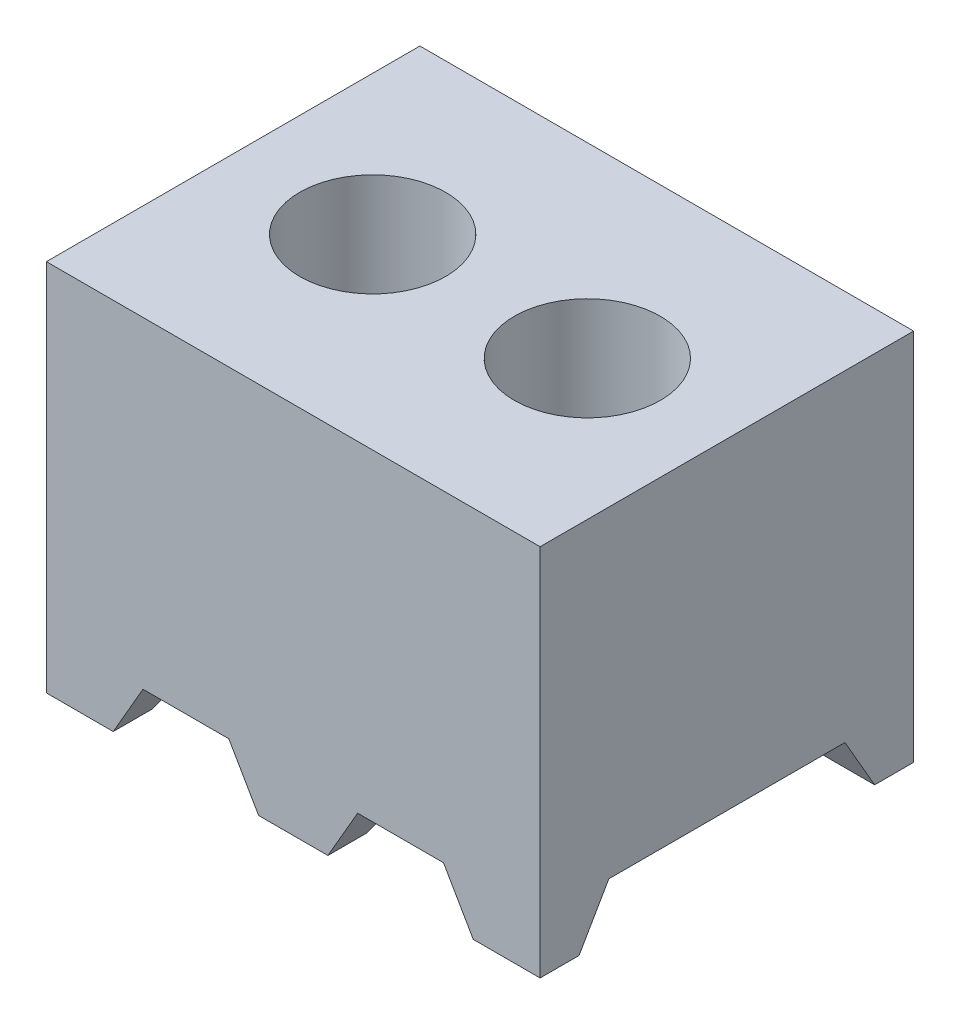
ISO-10303-21;
HEADER;
FILE_DESCRIPTION(('STEP AP214'),'2;1');
FILE_NAME('part.step','',(''),(''),'','','');
FILE_SCHEMA(('AUTOMOTIVE_DESIGN { 1 0 10303 214 1 1 1 1 }'));
ENDSEC;
DATA;
#1=APPLICATION_CONTEXT('core data for automotive mechanical design processes');
#2=APPLICATION_PROTOCOL_DEFINITION('international standard','automotive_design',2000,#1);
#3=PRODUCT_CONTEXT('',#1,'mechanical');
#4=PRODUCT('Part','Part','',(#3));
#5=PRODUCT_RELATED_PRODUCT_CATEGORY('part','',(#4));
#6=PRODUCT_DEFINITION_FORMATION('','',#4);
#7=PRODUCT_DEFINITION_CONTEXT('part definition',#1,'design');
#8=PRODUCT_DEFINITION('design','',#6,#7);
#9=PRODUCT_DEFINITION_SHAPE('','',#8);
#10=(LENGTH_UNIT() NAMED_UNIT(*) SI_UNIT(.MILLI.,.METRE.));
#11=(NAMED_UNIT(*) PLANE_ANGLE_UNIT() SI_UNIT($,.RADIAN.));
#12=(NAMED_UNIT(*) SI_UNIT($,.STERADIAN.) SOLID_ANGLE_UNIT());
#13=UNCERTAINTY_MEASURE_WITH_UNIT(LENGTH_MEASURE(1.E-05),#10,'distance_accuracy_value','');
#14=(GEOMETRIC_REPRESENTATION_CONTEXT(3) GLOBAL_UNCERTAINTY_ASSIGNED_CONTEXT((#13)) GLOBAL_UNIT_ASSIGNED_CONTEXT((#10,
#11,#12)) REPRESENTATION_CONTEXT('',''));
#15=CARTESIAN_POINT('',(0.,0.,0.));
#16=DIRECTION('',(0.,0.,1.));
#17=DIRECTION('',(1.,0.,0.));
#18=AXIS2_PLACEMENT_3D('',#15,#16,#17);
#19=CARTESIAN_POINT('',(0.,-2.2098,0.));
#20=DIRECTION('',(0.,1.,0.));
#21=DIRECTION('',(0.,0.,1.));
#22=AXIS2_PLACEMENT_3D('',#19,#20,#21);
#23=PLANE('',#22);
#24=DIRECTION('',(1.,0.,0.));
#25=VECTOR('',#24,1.);
#26=CARTESIAN_POINT('',(0.,-2.2098,0.));
#27=LINE('',#26,#25);
#28=CARTESIAN_POINT('',(2.525476362049,-2.2098,0.));
#29=VERTEX_POINT('',#28);
#30=CARTESIAN_POINT('',(2.921,-2.2098,0.));
#31=VERTEX_POINT('',#30);
#32=EDGE_CURVE('E311',#29,#31,#27,.T.);
#33=ORIENTED_EDGE('',*,*,#32,.F.);
#34=DIRECTION('',(0.,0.,1.));
#35=VECTOR('',#34,1.);
#36=CARTESIAN_POINT('',(2.525476362049,-2.2098,-2.2098));
#37=LINE('',#36,#35);
#38=CARTESIAN_POINT('',(2.525476362049,-2.2098,-0.230423637951));
#39=VERTEX_POINT('',#38);
#40=EDGE_CURVE('E215',#39,#29,#37,.T.);
#41=ORIENTED_EDGE('',*,*,#40,.F.);
#42=DIRECTION('',(1.,0.,0.));
#43=VECTOR('',#42,1.);
#44=CARTESIAN_POINT('',(0.,-2.2098,-0.230423637951));
#45=LINE('',#44,#43);
#46=CARTESIAN_POINT('',(2.921,-2.2098,-0.230423637951));
#47=VERTEX_POINT('',#46);
#48=EDGE_CURVE('E25',#39,#47,#45,.T.);
#49=ORIENTED_EDGE('',*,*,#48,.T.);
#50=DIRECTION('',(0.,0.,-1.));
#51=VECTOR('',#50,1.);
#52=CARTESIAN_POINT('',(2.921,-2.2098,0.));
#53=LINE('',#52,#51);
#54=EDGE_CURVE('E318',#31,#47,#53,.T.);
#55=ORIENTED_EDGE('',*,*,#54,.F.);
#56=EDGE_LOOP('',(#33,#41,#49,#55));
#57=FACE_BOUND('',#56,.T.);
#58=ADVANCED_FACE('F16',(#57),#23,.F.);
#59=DIRECTION('',(-1.,0.,0.));
#60=VECTOR('',#59,1.);
#61=CARTESIAN_POINT('',(0.,-2.2098,-1.979376362049));
#62=LINE('',#61,#60);
#63=CARTESIAN_POINT('',(2.921,-2.2098,-1.979376362049));
#64=VERTEX_POINT('',#63);
#65=CARTESIAN_POINT('',(2.525476362049,-2.2098,-1.979376362049));
#66=VERTEX_POINT('',#65);
#67=EDGE_CURVE('E344',#64,#66,#62,.T.);
#68=ORIENTED_EDGE('',*,*,#67,.T.);
#69=CARTESIAN_POINT('',(2.525476362049,-2.2098,-2.2098));
#70=VERTEX_POINT('',#69);
#71=EDGE_CURVE('E213',#70,#66,#37,.T.);
#72=ORIENTED_EDGE('',*,*,#71,.F.);
#73=DIRECTION('',(-1.,0.,0.));
#74=VECTOR('',#73,1.);
#75=CARTESIAN_POINT('',(2.921,-2.2098,-2.2098));
#76=LINE('',#75,#74);
#77=CARTESIAN_POINT('',(2.921,-2.2098,-2.2098));
#78=VERTEX_POINT('',#77);
#79=EDGE_CURVE('E322',#78,#70,#76,.T.);
#80=ORIENTED_EDGE('',*,*,#79,.F.);
#81=EDGE_CURVE('E316',#64,#78,#53,.T.);
#82=ORIENTED_EDGE('',*,*,#81,.F.);
#83=EDGE_LOOP('',(#68,#72,#80,#82));
#84=FACE_BOUND('',#83,.T.);
#85=ADVANCED_FACE('F396',(#84),#23,.F.);
#86=CARTESIAN_POINT('',(-60.96,-1.905,-0.406400000000001));
#87=DIRECTION('',(0.,0.500000000000006,0.866025403784435));
#88=DIRECTION('',(0.,-0.866025403784435,0.500000000000006));
#89=AXIS2_PLACEMENT_3D('',#86,#87,#88);
#90=PLANE('',#89);
#91=ORIENTED_EDGE('',*,*,#48,.F.);
#92=DIRECTION('',(-0.447213595499953,0.774596669241482,-0.447213595499965));
#93=VECTOR('',#92,1.);
#94=CARTESIAN_POINT('',(-10.3123999999997,20.0260541203561,-13.0683000000001));
#95=LINE('',#94,#93);
#96=CARTESIAN_POINT('',(2.3495,-1.905,-0.406400000000001));
#97=VERTEX_POINT('',#96);
#98=EDGE_CURVE('E224',#39,#97,#95,.T.);
#99=ORIENTED_EDGE('',*,*,#98,.T.);
#100=DIRECTION('',(1.,0.,0.));
#101=VECTOR('',#100,1.);
#102=CARTESIAN_POINT('',(-60.96,-1.905,-0.406400000000001));
#103=LINE('',#102,#101);
#104=CARTESIAN_POINT('',(2.921,-1.905,-0.406400000000001));
#105=VERTEX_POINT('',#104);
#106=EDGE_CURVE('E297',#97,#105,#103,.T.);
#107=ORIENTED_EDGE('',*,*,#106,.T.);
#108=DIRECTION('',(0.,-0.866025403784435,0.500000000000006));
#109=VECTOR('',#108,1.);
#110=CARTESIAN_POINT('',(2.921,-1.905,-0.406400000000001));
#111=LINE('',#110,#109);
#112=EDGE_CURVE('E282',#105,#47,#111,.T.);
#113=ORIENTED_EDGE('',*,*,#112,.T.);
#114=EDGE_LOOP('',(#91,#99,#107,#113));
#115=FACE_BOUND('',#114,.T.);
#116=ADVANCED_FACE('F402',(#115),#90,.F.);
#117=CARTESIAN_POINT('',(-60.96,-1.905,-1.80339999999999));
#118=DIRECTION('',(0.,0.500000000000012,-0.866025403784432));
#119=DIRECTION('',(0.,0.866025403784432,0.500000000000012));
#120=AXIS2_PLACEMENT_3D('',#117,#118,#119);
#121=PLANE('',#120);
#122=DIRECTION('',(1.,0.,0.));
#123=VECTOR('',#122,1.);
#124=CARTESIAN_POINT('',(-60.96,-1.905,-1.80339999999999));
#125=LINE('',#124,#123);
#126=CARTESIAN_POINT('',(2.3495,-1.905,-1.80339999999999));
#127=VERTEX_POINT('',#126);
#128=CARTESIAN_POINT('',(2.921,-1.905,-1.80339999999999));
#129=VERTEX_POINT('',#128);
#130=EDGE_CURVE('E291',#127,#129,#125,.T.);
#131=ORIENTED_EDGE('',*,*,#130,.F.);
#132=DIRECTION('',(0.447213595499952,-0.77459666924148,-0.44721359549997));
#133=VECTOR('',#132,1.);
#134=CARTESIAN_POINT('',(-10.3123999999997,20.026054120356,10.8585000000002));
#135=LINE('',#134,#133);
#136=EDGE_CURVE('E221',#127,#66,#135,.T.);
#137=ORIENTED_EDGE('',*,*,#136,.T.);
#138=ORIENTED_EDGE('',*,*,#67,.F.);
#139=DIRECTION('',(0.,0.866025403784432,0.500000000000012));
#140=VECTOR('',#139,1.);
#141=CARTESIAN_POINT('',(2.921,-1.905,-1.80339999999999));
#142=LINE('',#141,#140);
#143=EDGE_CURVE('E285',#64,#129,#142,.T.);
#144=ORIENTED_EDGE('',*,*,#143,.T.);
#145=EDGE_LOOP('',(#131,#137,#138,#144));
#146=FACE_BOUND('',#145,.T.);
#147=ADVANCED_FACE('F427',(#146),#121,.F.);
#148=CARTESIAN_POINT('',(1.255476362049,-2.2098,-0.230423637951));
#149=VERTEX_POINT('',#148);
#150=CARTESIAN_POINT('',(1.665523637951,-2.2098,-0.230423637951));
#151=VERTEX_POINT('',#150);
#152=EDGE_CURVE('E24',#149,#151,#45,.T.);
#153=ORIENTED_EDGE('',*,*,#152,.T.);
#154=DIRECTION('',(0.,0.,1.));
#155=VECTOR('',#154,1.);
#156=CARTESIAN_POINT('',(1.665523637951,-2.2098,-2.2098));
#157=LINE('',#156,#155);
#158=CARTESIAN_POINT('',(1.665523637951,-2.2098,0.));
#159=VERTEX_POINT('',#158);
#160=EDGE_CURVE('E189',#151,#159,#157,.T.);
#161=ORIENTED_EDGE('',*,*,#160,.T.);
#162=CARTESIAN_POINT('',(1.255476362049,-2.2098,0.));
#163=VERTEX_POINT('',#162);
#164=EDGE_CURVE('E317',#163,#159,#27,.T.);
#165=ORIENTED_EDGE('',*,*,#164,.F.);
#166=DIRECTION('',(0.,0.,1.));
#167=VECTOR('',#166,1.);
#168=CARTESIAN_POINT('',(1.255476362049,-2.2098,-2.2098));
#169=LINE('',#168,#167);
#170=EDGE_CURVE('E252',#149,#163,#169,.T.);
#171=ORIENTED_EDGE('',*,*,#170,.F.);
#172=EDGE_LOOP('',(#153,#161,#165,#171));
#173=FACE_BOUND('',#172,.T.);
#174=ADVANCED_FACE('F403',(#173),#23,.F.);
#175=CARTESIAN_POINT('',(1.665523637951,-2.2098,-2.2098));
#176=VERTEX_POINT('',#175);
#177=CARTESIAN_POINT('',(1.255476362049,-2.2098,-2.2098));
#178=VERTEX_POINT('',#177);
#179=EDGE_CURVE('E325',#176,#178,#76,.T.);
#180=ORIENTED_EDGE('',*,*,#179,.F.);
#181=CARTESIAN_POINT('',(1.665523637951,-2.2098,-1.979376362049));
#182=VERTEX_POINT('',#181);
#183=EDGE_CURVE('E32',#176,#182,#157,.T.);
#184=ORIENTED_EDGE('',*,*,#183,.T.);
#185=CARTESIAN_POINT('',(1.255476362049,-2.2098,-1.979376362049));
#186=VERTEX_POINT('',#185);
#187=EDGE_CURVE('E346',#182,#186,#62,.T.);
#188=ORIENTED_EDGE('',*,*,#187,.T.);
#189=EDGE_CURVE('E249',#178,#186,#169,.T.);
#190=ORIENTED_EDGE('',*,*,#189,.F.);
#191=EDGE_LOOP('',(#180,#184,#188,#190));
#192=FACE_BOUND('',#191,.T.);
#193=ADVANCED_FACE('F373',(#192),#23,.F.);
#194=CARTESIAN_POINT('',(1.0795,-1.905,-0.406400000000001));
#195=VERTEX_POINT('',#194);
#196=CARTESIAN_POINT('',(1.8415,-1.905,-0.406400000000001));
#197=VERTEX_POINT('',#196);
#198=EDGE_CURVE('E296',#195,#197,#103,.T.);
#199=ORIENTED_EDGE('',*,*,#198,.T.);
#200=DIRECTION('',(-0.447213595499953,-0.774596669241482,0.447213595499965));
#201=VECTOR('',#200,1.);
#202=CARTESIAN_POINT('',(-10.7187999999997,-23.6600777583071,12.1539));
#203=LINE('',#202,#201);
#204=EDGE_CURVE('E218',#197,#151,#203,.T.);
#205=ORIENTED_EDGE('',*,*,#204,.T.);
#206=ORIENTED_EDGE('',*,*,#152,.F.);
#207=DIRECTION('',(-0.447213595499953,0.774596669241482,-0.447213595499965));
#208=VECTOR('',#207,1.);
#209=CARTESIAN_POINT('',(-11.3283999999997,19.5861132152336,-12.8143000000001));
#210=LINE('',#209,#208);
#211=EDGE_CURVE('E267',#149,#195,#210,.T.);
#212=ORIENTED_EDGE('',*,*,#211,.T.);
#213=EDGE_LOOP('',(#199,#205,#206,#212));
#214=FACE_BOUND('',#213,.T.);
#215=ADVANCED_FACE('F425',(#214),#90,.F.);
#216=ORIENTED_EDGE('',*,*,#187,.F.);
#217=DIRECTION('',(0.447213595499951,0.77459666924148,0.44721359549997));
#218=VECTOR('',#217,1.);
#219=CARTESIAN_POINT('',(-10.7187999999996,-23.660077758307,-14.3637000000002));
#220=LINE('',#219,#218);
#221=CARTESIAN_POINT('',(1.8415,-1.905,-1.80339999999999));
#222=VERTEX_POINT('',#221);
#223=EDGE_CURVE('E211',#182,#222,#220,.T.);
#224=ORIENTED_EDGE('',*,*,#223,.T.);
#225=CARTESIAN_POINT('',(1.0795,-1.905,-1.8034));
#226=VERTEX_POINT('',#225);
#227=EDGE_CURVE('E187',#226,#222,#125,.T.);
#228=ORIENTED_EDGE('',*,*,#227,.F.);
#229=DIRECTION('',(0.447213595499952,-0.77459666924148,-0.44721359549997));
#230=VECTOR('',#229,1.);
#231=CARTESIAN_POINT('',(-11.3283999999997,19.5861132152335,10.6045000000002));
#232=LINE('',#231,#230);
#233=EDGE_CURVE('E264',#226,#186,#232,.T.);
#234=ORIENTED_EDGE('',*,*,#233,.T.);
#235=EDGE_LOOP('',(#216,#224,#228,#234));
#236=FACE_BOUND('',#235,.T.);
#237=ADVANCED_FACE('F376',(#236),#121,.F.);
#238=CARTESIAN_POINT('',(0.,-2.2098,-0.230423637951));
#239=VERTEX_POINT('',#238);
#240=CARTESIAN_POINT('',(0.395523637950997,-2.2098,-0.230423637950999));
#241=VERTEX_POINT('',#240);
#242=EDGE_CURVE('E11',#239,#241,#45,.T.);
#243=ORIENTED_EDGE('',*,*,#242,.T.);
#244=DIRECTION('',(0.,0.,1.));
#245=VECTOR('',#244,1.);
#246=CARTESIAN_POINT('',(0.395523637951004,-2.2098,-2.2098));
#247=LINE('',#246,#245);
#248=CARTESIAN_POINT('',(0.395523637951004,-2.2098,0.));
#249=VERTEX_POINT('',#248);
#250=EDGE_CURVE('E256',#241,#249,#247,.T.);
#251=ORIENTED_EDGE('',*,*,#250,.T.);
#252=CARTESIAN_POINT('',(0.,-2.2098,0.));
#253=VERTEX_POINT('',#252);
#254=EDGE_CURVE('E313',#253,#249,#27,.T.);
#255=ORIENTED_EDGE('',*,*,#254,.F.);
#256=DIRECTION('',(0.,0.,1.));
#257=VECTOR('',#256,1.);
#258=CARTESIAN_POINT('',(0.,-2.2098,-2.2098));
#259=LINE('',#258,#257);
#260=EDGE_CURVE('E312',#239,#253,#259,.T.);
#261=ORIENTED_EDGE('',*,*,#260,.F.);
#262=EDGE_LOOP('',(#243,#251,#255,#261));
#263=FACE_BOUND('',#262,.T.);
#264=ADVANCED_FACE('F410',(#263),#23,.F.);
#265=CARTESIAN_POINT('',(0.,-2.2098,-2.2098));
#266=DIRECTION('',(-1.,0.,0.));
#267=DIRECTION('',(0.,0.,1.));
#268=AXIS2_PLACEMENT_3D('',#265,#266,#267);
#269=PLANE('',#268);
#270=DIRECTION('',(0.,0.866025403784435,-0.500000000000006));
#271=VECTOR('',#270,1.);
#272=CARTESIAN_POINT('',(0.,-1.35270489340756,-0.725267728463262));
#273=LINE('',#272,#271);
#274=CARTESIAN_POINT('',(0.,-1.905,-0.406400000000001));
#275=VERTEX_POINT('',#274);
#276=EDGE_CURVE('E303',#239,#275,#273,.T.);
#277=ORIENTED_EDGE('',*,*,#276,.F.);
#278=ORIENTED_EDGE('',*,*,#260,.T.);
#279=DIRECTION('',(0.,1.,0.));
#280=VECTOR('',#279,1.);
#281=CARTESIAN_POINT('',(0.,-2.2098,0.));
#282=LINE('',#281,#280);
#283=CARTESIAN_POINT('',(0.,0.,0.));
#284=VERTEX_POINT('',#283);
#285=EDGE_CURVE('E324',#253,#284,#282,.T.);
#286=ORIENTED_EDGE('',*,*,#285,.T.);
#287=DIRECTION('',(0.,0.,1.));
#288=VECTOR('',#287,1.);
#289=CARTESIAN_POINT('',(0.,0.,-2.2098));
#290=LINE('',#289,#288);
#291=CARTESIAN_POINT('',(0.,0.,-2.2098));
#292=VERTEX_POINT('',#291);
#293=EDGE_CURVE('E307',#292,#284,#290,.T.);
#294=ORIENTED_EDGE('',*,*,#293,.F.);
#295=DIRECTION('',(0.,1.,0.));
#296=VECTOR('',#295,1.);
#297=CARTESIAN_POINT('',(0.,-2.2098,-2.2098));
#298=LINE('',#297,#296);
#299=CARTESIAN_POINT('',(0.,-2.2098,-2.2098));
#300=VERTEX_POINT('',#299);
#301=EDGE_CURVE('E337',#300,#292,#298,.T.);
#302=ORIENTED_EDGE('',*,*,#301,.F.);
#303=CARTESIAN_POINT('',(0.,-2.2098,-1.979376362049));
#304=VERTEX_POINT('',#303);
#305=EDGE_CURVE('E308',#300,#304,#259,.T.);
#306=ORIENTED_EDGE('',*,*,#305,.T.);
#307=DIRECTION('',(0.,-0.866025403784432,-0.500000000000012));
#308=VECTOR('',#307,1.);
#309=CARTESIAN_POINT('',(0.,-2.309576362049,-2.03698227153675));
#310=LINE('',#309,#308);
#311=CARTESIAN_POINT('',(0.,-1.905,-1.80339999999999));
#312=VERTEX_POINT('',#311);
#313=EDGE_CURVE('E295',#312,#304,#310,.T.);
#314=ORIENTED_EDGE('',*,*,#313,.F.);
#315=DIRECTION('',(0.,0.,-1.));
#316=VECTOR('',#315,1.);
#317=CARTESIAN_POINT('',(0.,-1.905,-2.2098));
#318=LINE('',#317,#316);
#319=EDGE_CURVE('E305',#275,#312,#318,.T.);
#320=ORIENTED_EDGE('',*,*,#319,.F.);
#321=EDGE_LOOP('',(#277,#278,#286,#294,#302,#306,#314,#320));
#322=FACE_BOUND('',#321,.T.);
#323=ADVANCED_FACE('F18',(#322),#269,.T.);
#324=CARTESIAN_POINT('',(2.921,-2.2098,-2.2098));
#325=DIRECTION('',(0.,0.,-1.));
#326=DIRECTION('',(-1.,0.,0.));
#327=AXIS2_PLACEMENT_3D('',#324,#325,#326);
#328=PLANE('',#327);
#329=DIRECTION('',(-0.499999999999997,0.866025403784441,0.));
#330=VECTOR('',#329,1.);
#331=CARTESIAN_POINT('',(2.525476362049,-2.2098,-2.2098));
#332=LINE('',#331,#330);
#333=CARTESIAN_POINT('',(2.3495,-1.905,-2.2098));
#334=VERTEX_POINT('',#333);
#335=EDGE_CURVE('E196',#70,#334,#332,.T.);
#336=ORIENTED_EDGE('',*,*,#335,.T.);
#337=DIRECTION('',(-1.,0.,0.));
#338=VECTOR('',#337,1.);
#339=CARTESIAN_POINT('',(1.8415,-1.905,-2.2098));
#340=LINE('',#339,#338);
#341=CARTESIAN_POINT('',(1.8415,-1.905,-2.2098));
#342=VERTEX_POINT('',#341);
#343=EDGE_CURVE('E183',#334,#342,#340,.T.);
#344=ORIENTED_EDGE('',*,*,#343,.T.);
#345=DIRECTION('',(-0.499999999999996,-0.866025403784441,0.));
#346=VECTOR('',#345,1.);
#347=CARTESIAN_POINT('',(1.665523637951,-2.2098,-2.2098));
#348=LINE('',#347,#346);
#349=EDGE_CURVE('E192',#342,#176,#348,.T.);
#350=ORIENTED_EDGE('',*,*,#349,.T.);
#351=ORIENTED_EDGE('',*,*,#179,.T.);
#352=DIRECTION('',(-0.499999999999997,0.866025403784441,0.));
#353=VECTOR('',#352,1.);
#354=CARTESIAN_POINT('',(1.255476362049,-2.2098,-2.2098));
#355=LINE('',#354,#353);
#356=CARTESIAN_POINT('',(1.0795,-1.905,-2.2098));
#357=VERTEX_POINT('',#356);
#358=EDGE_CURVE('E235',#178,#357,#355,.T.);
#359=ORIENTED_EDGE('',*,*,#358,.T.);
#360=DIRECTION('',(-1.,0.,0.));
#361=VECTOR('',#360,1.);
#362=CARTESIAN_POINT('',(0.5715,-1.905,-2.2098));
#363=LINE('',#362,#361);
#364=CARTESIAN_POINT('',(0.5715,-1.905,-2.2098));
#365=VERTEX_POINT('',#364);
#366=EDGE_CURVE('E228',#357,#365,#363,.T.);
#367=ORIENTED_EDGE('',*,*,#366,.T.);
#368=DIRECTION('',(-0.499999999999996,-0.866025403784441,0.));
#369=VECTOR('',#368,1.);
#370=CARTESIAN_POINT('',(0.395523637951004,-2.2098,-2.2098));
#371=LINE('',#370,#369);
#372=CARTESIAN_POINT('',(0.395523637951004,-2.2098,-2.2098));
#373=VERTEX_POINT('',#372);
#374=EDGE_CURVE('E231',#365,#373,#371,.T.);
#375=ORIENTED_EDGE('',*,*,#374,.T.);
#376=EDGE_CURVE('E321',#373,#300,#76,.T.);
#377=ORIENTED_EDGE('',*,*,#376,.T.);
#378=ORIENTED_EDGE('',*,*,#301,.T.);
#379=DIRECTION('',(-1.,0.,0.));
#380=VECTOR('',#379,1.);
#381=CARTESIAN_POINT('',(2.921,0.,-2.2098));
#382=LINE('',#381,#380);
#383=CARTESIAN_POINT('',(2.921,0.,-2.2098));
#384=VERTEX_POINT('',#383);
#385=EDGE_CURVE('E334',#384,#292,#382,.T.);
#386=ORIENTED_EDGE('',*,*,#385,.F.);
#387=DIRECTION('',(0.,1.,0.));
#388=VECTOR('',#387,1.);
#389=CARTESIAN_POINT('',(2.921,-2.2098,-2.2098));
#390=LINE('',#389,#388);
#391=EDGE_CURVE('E340',#78,#384,#390,.T.);
#392=ORIENTED_EDGE('',*,*,#391,.F.);
#393=ORIENTED_EDGE('',*,*,#79,.T.);
#394=EDGE_LOOP('',(#336,#344,#350,#351,#359,#367,#375,#377,#378,#386,#392,#393));
#395=FACE_BOUND('',#394,.T.);
#396=ADVANCED_FACE('F198',(#395),#328,.T.);
#397=CARTESIAN_POINT('',(2.921,-2.2098,0.));
#398=DIRECTION('',(1.,0.,0.));
#399=DIRECTION('',(0.,0.,-1.));
#400=AXIS2_PLACEMENT_3D('',#397,#398,#399);
#401=PLANE('',#400);
#402=ORIENTED_EDGE('',*,*,#112,.F.);
#403=DIRECTION('',(0.,0.,1.));
#404=VECTOR('',#403,1.);
#405=CARTESIAN_POINT('',(2.921,-1.905,-0.406400000000001));
#406=LINE('',#405,#404);
#407=EDGE_CURVE('E288',#129,#105,#406,.T.);
#408=ORIENTED_EDGE('',*,*,#407,.F.);
#409=ORIENTED_EDGE('',*,*,#143,.F.);
#410=ORIENTED_EDGE('',*,*,#81,.T.);
#411=ORIENTED_EDGE('',*,*,#391,.T.);
#412=DIRECTION('',(0.,0.,-1.));
#413=VECTOR('',#412,1.);
#414=CARTESIAN_POINT('',(2.921,0.,0.));
#415=LINE('',#414,#413);
#416=CARTESIAN_POINT('',(2.921,0.,0.));
#417=VERTEX_POINT('',#416);
#418=EDGE_CURVE('E331',#417,#384,#415,.T.);
#419=ORIENTED_EDGE('',*,*,#418,.F.);
#420=DIRECTION('',(0.,1.,0.));
#421=VECTOR('',#420,1.);
#422=CARTESIAN_POINT('',(2.921,-2.2098,0.));
#423=LINE('',#422,#421);
#424=EDGE_CURVE('E342',#31,#417,#423,.T.);
#425=ORIENTED_EDGE('',*,*,#424,.F.);
#426=ORIENTED_EDGE('',*,*,#54,.T.);
#427=EDGE_LOOP('',(#402,#408,#409,#410,#411,#419,#425,#426));
#428=FACE_BOUND('',#427,.T.);
#429=ADVANCED_FACE('F417',(#428),#401,.T.);
#430=CARTESIAN_POINT('',(0.,-2.2098,0.));
#431=DIRECTION('',(0.,0.,1.));
#432=DIRECTION('',(1.,0.,0.));
#433=AXIS2_PLACEMENT_3D('',#430,#431,#432);
#434=PLANE('',#433);
#435=DIRECTION('',(-0.499999999999997,0.866025403784441,0.));
#436=VECTOR('',#435,1.);
#437=CARTESIAN_POINT('',(2.525476362049,-2.2098,0.));
#438=LINE('',#437,#436);
#439=CARTESIAN_POINT('',(2.3495,-1.905,0.));
#440=VERTEX_POINT('',#439);
#441=EDGE_CURVE('E200',#29,#440,#438,.T.);
#442=ORIENTED_EDGE('',*,*,#441,.F.);
#443=ORIENTED_EDGE('',*,*,#32,.T.);
#444=ORIENTED_EDGE('',*,*,#424,.T.);
#445=DIRECTION('',(1.,0.,0.));
#446=VECTOR('',#445,1.);
#447=CARTESIAN_POINT('',(0.,0.,0.));
#448=LINE('',#447,#446);
#449=EDGE_CURVE('E328',#284,#417,#448,.T.);
#450=ORIENTED_EDGE('',*,*,#449,.F.);
#451=ORIENTED_EDGE('',*,*,#285,.F.);
#452=ORIENTED_EDGE('',*,*,#254,.T.);
#453=DIRECTION('',(-0.499999999999996,-0.866025403784441,0.));
#454=VECTOR('',#453,1.);
#455=CARTESIAN_POINT('',(0.395523637951004,-2.2098,0.));
#456=LINE('',#455,#454);
#457=CARTESIAN_POINT('',(0.5715,-1.905,0.));
#458=VERTEX_POINT('',#457);
#459=EDGE_CURVE('E241',#458,#249,#456,.T.);
#460=ORIENTED_EDGE('',*,*,#459,.F.);
#461=DIRECTION('',(-1.,0.,0.));
#462=VECTOR('',#461,1.);
#463=CARTESIAN_POINT('',(0.5715,-1.905,0.));
#464=LINE('',#463,#462);
#465=CARTESIAN_POINT('',(1.0795,-1.905,0.));
#466=VERTEX_POINT('',#465);
#467=EDGE_CURVE('E227',#466,#458,#464,.T.);
#468=ORIENTED_EDGE('',*,*,#467,.F.);
#469=DIRECTION('',(-0.499999999999997,0.866025403784441,0.));
#470=VECTOR('',#469,1.);
#471=CARTESIAN_POINT('',(1.255476362049,-2.2098,0.));
#472=LINE('',#471,#470);
#473=EDGE_CURVE('E232',#163,#466,#472,.T.);
#474=ORIENTED_EDGE('',*,*,#473,.F.);
#475=ORIENTED_EDGE('',*,*,#164,.T.);
#476=DIRECTION('',(-0.499999999999996,-0.866025403784441,0.));
#477=VECTOR('',#476,1.);
#478=CARTESIAN_POINT('',(1.665523637951,-2.2098,0.));
#479=LINE('',#478,#477);
#480=CARTESIAN_POINT('',(1.8415,-1.905,0.));
#481=VERTEX_POINT('',#480);
#482=EDGE_CURVE('E203',#481,#159,#479,.T.);
#483=ORIENTED_EDGE('',*,*,#482,.F.);
#484=DIRECTION('',(-1.,0.,0.));
#485=VECTOR('',#484,1.);
#486=CARTESIAN_POINT('',(1.8415,-1.905,0.));
#487=LINE('',#486,#485);
#488=EDGE_CURVE('E40',#440,#481,#487,.T.);
#489=ORIENTED_EDGE('',*,*,#488,.F.);
#490=EDGE_LOOP('',(#442,#443,#444,#450,#451,#452,#460,#468,#474,#475,#483,#489));
#491=FACE_BOUND('',#490,.T.);
#492=ADVANCED_FACE('F409',(#491),#434,.T.);
#493=ORIENTED_EDGE('',*,*,#376,.F.);
#494=CARTESIAN_POINT('',(0.395523637951003,-2.2098,-1.979376362049));
#495=VERTEX_POINT('',#494);
#496=EDGE_CURVE('E253',#373,#495,#247,.T.);
#497=ORIENTED_EDGE('',*,*,#496,.T.);
#498=EDGE_CURVE('E339',#495,#304,#62,.T.);
#499=ORIENTED_EDGE('',*,*,#498,.T.);
#500=ORIENTED_EDGE('',*,*,#305,.F.);
#501=EDGE_LOOP('',(#493,#497,#499,#500));
#502=FACE_BOUND('',#501,.T.);
#503=ADVANCED_FACE('F354',(#502),#23,.F.);
#504=CARTESIAN_POINT('',(0.,0.,0.));
#505=DIRECTION('',(0.,1.,0.));
#506=DIRECTION('',(0.,0.,1.));
#507=AXIS2_PLACEMENT_3D('',#504,#505,#506);
#508=PLANE('',#507);
#509=CARTESIAN_POINT('',(2.0955,0.,-1.1049));
#510=DIRECTION('',(0.,1.,0.));
#511=DIRECTION('',(0.,0.,1.));
#512=AXIS2_PLACEMENT_3D('',#509,#510,#511);
#513=CIRCLE('',#512,0.431800000000013);
#514=CARTESIAN_POINT('',(2.0955,0.,-0.673099999999986));
#515=VERTEX_POINT('',#514);
#516=EDGE_CURVE('E270',#515,#515,#513,.T.);
#517=ORIENTED_EDGE('',*,*,#516,.F.);
#518=EDGE_LOOP('',(#517));
#519=FACE_BOUND('',#518,.T.);
#520=CARTESIAN_POINT('',(0.825499999999998,0.,-1.1049));
#521=DIRECTION('',(0.,1.,0.));
#522=DIRECTION('',(0.,0.,1.));
#523=AXIS2_PLACEMENT_3D('',#520,#521,#522);
#524=CIRCLE('',#523,0.431800000000014);
#525=CARTESIAN_POINT('',(0.825499999999998,0.,-0.673099999999986));
#526=VERTEX_POINT('',#525);
#527=EDGE_CURVE('E276',#526,#526,#524,.T.);
#528=ORIENTED_EDGE('',*,*,#527,.F.);
#529=EDGE_LOOP('',(#528));
#530=FACE_BOUND('',#529,.T.);
#531=ORIENTED_EDGE('',*,*,#293,.T.);
#532=ORIENTED_EDGE('',*,*,#449,.T.);
#533=ORIENTED_EDGE('',*,*,#418,.T.);
#534=ORIENTED_EDGE('',*,*,#385,.T.);
#535=EDGE_LOOP('',(#531,#532,#533,#534));
#536=FACE_BOUND('',#535,.T.);
#537=ADVANCED_FACE('F408',(#519,#530,#536),#508,.T.);
#538=CARTESIAN_POINT('',(0.5715,-1.905,-0.406400000000001));
#539=VERTEX_POINT('',#538);
#540=EDGE_CURVE('E292',#275,#539,#103,.T.);
#541=ORIENTED_EDGE('',*,*,#540,.T.);
#542=DIRECTION('',(-0.447213595499953,-0.774596669241482,0.447213595499965));
#543=VECTOR('',#542,1.);
#544=CARTESIAN_POINT('',(-11.7347999999997,-23.2201368531846,11.8999));
#545=LINE('',#544,#543);
#546=EDGE_CURVE('E261',#539,#241,#545,.T.);
#547=ORIENTED_EDGE('',*,*,#546,.T.);
#548=ORIENTED_EDGE('',*,*,#242,.F.);
#549=ORIENTED_EDGE('',*,*,#276,.T.);
#550=EDGE_LOOP('',(#541,#547,#548,#549));
#551=FACE_BOUND('',#550,.T.);
#552=ADVANCED_FACE('F415',(#551),#90,.F.);
#553=CARTESIAN_POINT('',(-60.96,-1.905,-0.406400000000001));
#554=DIRECTION('',(0.,1.,0.));
#555=DIRECTION('',(0.,0.,1.));
#556=AXIS2_PLACEMENT_3D('',#553,#554,#555);
#557=PLANE('',#556);
#558=CARTESIAN_POINT('',(2.0955,-1.905,-1.1049));
#559=DIRECTION('',(0.,1.,0.));
#560=DIRECTION('',(0.,0.,1.));
#561=AXIS2_PLACEMENT_3D('',#558,#559,#560);
#562=CIRCLE('',#561,0.431800000000013);
#563=CARTESIAN_POINT('',(2.0955,-1.905,-0.673099999999986));
#564=VERTEX_POINT('',#563);
#565=EDGE_CURVE('E273',#564,#564,#562,.T.);
#566=ORIENTED_EDGE('',*,*,#565,.T.);
#567=EDGE_LOOP('',(#566));
#568=FACE_BOUND('',#567,.T.);
#569=CARTESIAN_POINT('',(0.825499999999998,-1.905,-1.1049));
#570=DIRECTION('',(0.,1.,0.));
#571=DIRECTION('',(0.,0.,1.));
#572=AXIS2_PLACEMENT_3D('',#569,#570,#571);
#573=CIRCLE('',#572,0.431800000000013);
#574=CARTESIAN_POINT('',(0.825499999999998,-1.905,-0.673099999999986));
#575=VERTEX_POINT('',#574);
#576=EDGE_CURVE('E279',#575,#575,#573,.T.);
#577=ORIENTED_EDGE('',*,*,#576,.T.);
#578=EDGE_LOOP('',(#577));
#579=FACE_BOUND('',#578,.T.);
#580=ORIENTED_EDGE('',*,*,#227,.T.);
#581=DIRECTION('',(0.,0.,1.));
#582=VECTOR('',#581,1.);
#583=CARTESIAN_POINT('',(1.8415,-1.905,-2.2098));
#584=LINE('',#583,#582);
#585=EDGE_CURVE('E179',#342,#222,#584,.T.);
#586=ORIENTED_EDGE('',*,*,#585,.F.);
#587=ORIENTED_EDGE('',*,*,#343,.F.);
#588=DIRECTION('',(0.,0.,1.));
#589=VECTOR('',#588,1.);
#590=CARTESIAN_POINT('',(2.3495,-1.905,-2.2098));
#591=LINE('',#590,#589);
#592=EDGE_CURVE('E209',#334,#127,#591,.T.);
#593=ORIENTED_EDGE('',*,*,#592,.T.);
#594=ORIENTED_EDGE('',*,*,#130,.T.);
#595=ORIENTED_EDGE('',*,*,#407,.T.);
#596=ORIENTED_EDGE('',*,*,#106,.F.);
#597=EDGE_CURVE('E212',#97,#440,#591,.T.);
#598=ORIENTED_EDGE('',*,*,#597,.T.);
#599=ORIENTED_EDGE('',*,*,#488,.T.);
#600=EDGE_CURVE('E190',#197,#481,#584,.T.);
#601=ORIENTED_EDGE('',*,*,#600,.F.);
#602=ORIENTED_EDGE('',*,*,#198,.F.);
#603=DIRECTION('',(0.,0.,1.));
#604=VECTOR('',#603,1.);
#605=CARTESIAN_POINT('',(1.0795,-1.905,-2.2098));
#606=LINE('',#605,#604);
#607=EDGE_CURVE('E248',#195,#466,#606,.T.);
#608=ORIENTED_EDGE('',*,*,#607,.T.);
#609=ORIENTED_EDGE('',*,*,#467,.T.);
#610=DIRECTION('',(0.,0.,1.));
#611=VECTOR('',#610,1.);
#612=CARTESIAN_POINT('',(0.5715,-1.905,-2.2098));
#613=LINE('',#612,#611);
#614=EDGE_CURVE('E238',#539,#458,#613,.T.);
#615=ORIENTED_EDGE('',*,*,#614,.F.);
#616=ORIENTED_EDGE('',*,*,#540,.F.);
#617=ORIENTED_EDGE('',*,*,#319,.T.);
#618=CARTESIAN_POINT('',(0.571500000000005,-1.905,-1.80339999999999));
#619=VERTEX_POINT('',#618);
#620=EDGE_CURVE('E298',#312,#619,#125,.T.);
#621=ORIENTED_EDGE('',*,*,#620,.T.);
#622=EDGE_CURVE('E257',#365,#619,#613,.T.);
#623=ORIENTED_EDGE('',*,*,#622,.F.);
#624=ORIENTED_EDGE('',*,*,#366,.F.);
#625=EDGE_CURVE('E245',#357,#226,#606,.T.);
#626=ORIENTED_EDGE('',*,*,#625,.T.);
#627=EDGE_LOOP('',(#580,#586,#587,#593,#594,#595,#596,#598,#599,#601,#602,#608,#609,#615,#616,
#617,#621,#623,#624,#626));
#628=FACE_BOUND('',#627,.T.);
#629=ADVANCED_FACE('F180',(#568,#579,#628),#557,.F.);
#630=ORIENTED_EDGE('',*,*,#498,.F.);
#631=DIRECTION('',(0.447213595499951,0.77459666924148,0.44721359549997));
#632=VECTOR('',#631,1.);
#633=CARTESIAN_POINT('',(-11.7347999999996,-23.2201368531845,-14.1097000000002));
#634=LINE('',#633,#632);
#635=EDGE_CURVE('E247',#495,#619,#634,.T.);
#636=ORIENTED_EDGE('',*,*,#635,.T.);
#637=ORIENTED_EDGE('',*,*,#620,.F.);
#638=ORIENTED_EDGE('',*,*,#313,.T.);
#639=EDGE_LOOP('',(#630,#636,#637,#638));
#640=FACE_BOUND('',#639,.T.);
#641=ADVANCED_FACE('F358',(#640),#121,.F.);
#642=CARTESIAN_POINT('',(0.825499999999998,0.,-1.1049));
#643=DIRECTION('',(0.,1.,0.));
#644=DIRECTION('',(0.,0.,1.));
#645=AXIS2_PLACEMENT_3D('',#642,#643,#644);
#646=CYLINDRICAL_SURFACE('',#645,0.431800000000013);
#647=ORIENTED_EDGE('',*,*,#527,.T.);
#648=EDGE_LOOP('',(#647));
#649=FACE_BOUND('',#648,.T.);
#650=ORIENTED_EDGE('',*,*,#576,.F.);
#651=EDGE_LOOP('',(#650));
#652=FACE_BOUND('',#651,.T.);
#653=ADVANCED_FACE('F602',(#649,#652),#646,.F.);
#654=CARTESIAN_POINT('',(2.0955,0.,-1.1049));
#655=DIRECTION('',(0.,1.,0.));
#656=DIRECTION('',(0.,0.,1.));
#657=AXIS2_PLACEMENT_3D('',#654,#655,#656);
#658=CYLINDRICAL_SURFACE('',#657,0.431800000000013);
#659=ORIENTED_EDGE('',*,*,#516,.T.);
#660=EDGE_LOOP('',(#659));
#661=FACE_BOUND('',#660,.T.);
#662=ORIENTED_EDGE('',*,*,#565,.F.);
#663=EDGE_LOOP('',(#662));
#664=FACE_BOUND('',#663,.T.);
#665=ADVANCED_FACE('F390',(#661,#664),#658,.F.);
#666=CARTESIAN_POINT('',(1.255476362049,-2.2098,-2.2098));
#667=DIRECTION('',(0.866025403784441,0.499999999999996,0.));
#668=DIRECTION('',(-0.499999999999997,0.866025403784441,0.));
#669=AXIS2_PLACEMENT_3D('',#666,#667,#668);
#670=PLANE('',#669);
#671=ORIENTED_EDGE('',*,*,#625,.F.);
#672=ORIENTED_EDGE('',*,*,#358,.F.);
#673=ORIENTED_EDGE('',*,*,#189,.T.);
#674=ORIENTED_EDGE('',*,*,#233,.F.);
#675=EDGE_LOOP('',(#671,#672,#673,#674));
#676=FACE_BOUND('',#675,.T.);
#677=ADVANCED_FACE('F371',(#676),#670,.F.);
#678=CARTESIAN_POINT('',(0.395523637951004,-2.2098,-2.2098));
#679=DIRECTION('',(-0.866025403784441,0.499999999999996,0.));
#680=DIRECTION('',(-0.499999999999996,-0.866025403784441,0.));
#681=AXIS2_PLACEMENT_3D('',#678,#679,#680);
#682=PLANE('',#681);
#683=ORIENTED_EDGE('',*,*,#496,.F.);
#684=ORIENTED_EDGE('',*,*,#374,.F.);
#685=ORIENTED_EDGE('',*,*,#622,.T.);
#686=ORIENTED_EDGE('',*,*,#635,.F.);
#687=EDGE_LOOP('',(#683,#684,#685,#686));
#688=FACE_BOUND('',#687,.T.);
#689=ADVANCED_FACE('F378',(#688),#682,.F.);
#690=ORIENTED_EDGE('',*,*,#170,.T.);
#691=ORIENTED_EDGE('',*,*,#473,.T.);
#692=ORIENTED_EDGE('',*,*,#607,.F.);
#693=ORIENTED_EDGE('',*,*,#211,.F.);
#694=EDGE_LOOP('',(#690,#691,#692,#693));
#695=FACE_BOUND('',#694,.T.);
#696=ADVANCED_FACE('F380',(#695),#670,.F.);
#697=ORIENTED_EDGE('',*,*,#614,.T.);
#698=ORIENTED_EDGE('',*,*,#459,.T.);
#699=ORIENTED_EDGE('',*,*,#250,.F.);
#700=ORIENTED_EDGE('',*,*,#546,.F.);
#701=EDGE_LOOP('',(#697,#698,#699,#700));
#702=FACE_BOUND('',#701,.T.);
#703=ADVANCED_FACE('F382',(#702),#682,.F.);
#704=CARTESIAN_POINT('',(1.665523637951,-2.2098,-2.2098));
#705=DIRECTION('',(-0.866025403784441,0.499999999999996,0.));
#706=DIRECTION('',(-0.499999999999996,-0.866025403784441,0.));
#707=AXIS2_PLACEMENT_3D('',#704,#705,#706);
#708=PLANE('',#707);
#709=ORIENTED_EDGE('',*,*,#600,.T.);
#710=ORIENTED_EDGE('',*,*,#482,.T.);
#711=ORIENTED_EDGE('',*,*,#160,.F.);
#712=ORIENTED_EDGE('',*,*,#204,.F.);
#713=EDGE_LOOP('',(#709,#710,#711,#712));
#714=FACE_BOUND('',#713,.T.);
#715=ADVANCED_FACE('F393',(#714),#708,.F.);
#716=CARTESIAN_POINT('',(2.525476362049,-2.2098,-2.2098));
#717=DIRECTION('',(0.866025403784441,0.499999999999996,0.));
#718=DIRECTION('',(-0.499999999999997,0.866025403784441,0.));
#719=AXIS2_PLACEMENT_3D('',#716,#717,#718);
#720=PLANE('',#719);
#721=ORIENTED_EDGE('',*,*,#40,.T.);
#722=ORIENTED_EDGE('',*,*,#441,.T.);
#723=ORIENTED_EDGE('',*,*,#597,.F.);
#724=ORIENTED_EDGE('',*,*,#98,.F.);
#725=EDGE_LOOP('',(#721,#722,#723,#724));
#726=FACE_BOUND('',#725,.T.);
#727=ADVANCED_FACE('F463',(#726),#720,.F.);
#728=ORIENTED_EDGE('',*,*,#592,.F.);
#729=ORIENTED_EDGE('',*,*,#335,.F.);
#730=ORIENTED_EDGE('',*,*,#71,.T.);
#731=ORIENTED_EDGE('',*,*,#136,.F.);
#732=EDGE_LOOP('',(#728,#729,#730,#731));
#733=FACE_BOUND('',#732,.T.);
#734=ADVANCED_FACE('F478',(#733),#720,.F.);
#735=ORIENTED_EDGE('',*,*,#183,.F.);
#736=ORIENTED_EDGE('',*,*,#349,.F.);
#737=ORIENTED_EDGE('',*,*,#585,.T.);
#738=ORIENTED_EDGE('',*,*,#223,.F.);
#739=EDGE_LOOP('',(#735,#736,#737,#738));
#740=FACE_BOUND('',#739,.T.);
#741=ADVANCED_FACE('F193',(#740),#708,.F.);
#742=CLOSED_SHELL('',(#58,#85,#116,#147,#174,#193,#215,#237,#264,#323,#396,#429,#492,#503,#537,
#552,#629,#641,#653,#665,#677,#689,#696,#703,#715,#727,#734,#741));
#743=MANIFOLD_SOLID_BREP('B1',#742);
#744=ADVANCED_BREP_SHAPE_REPRESENTATION('',(#18,#743),#14);
#745=SHAPE_DEFINITION_REPRESENTATION(#9,#744);
ENDSEC;
END-ISO-10303-21;
